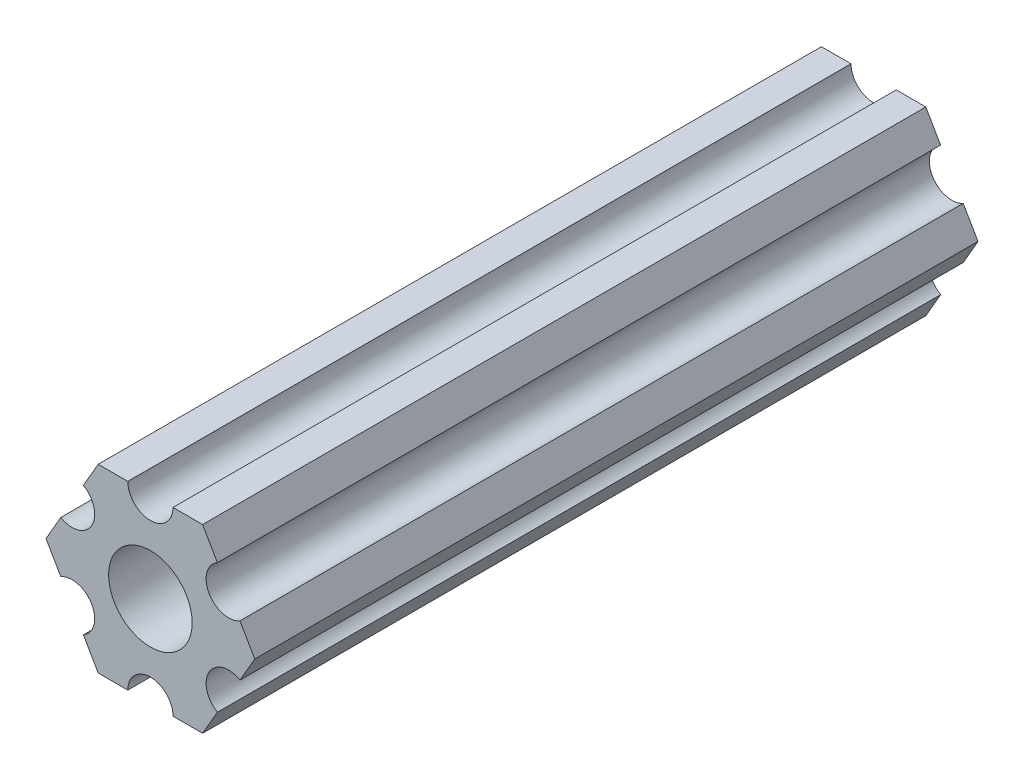
ISO-10303-21;
HEADER;
FILE_DESCRIPTION(('STEP AP214'),'2;1');
FILE_NAME('part.step','',(''),(''),'','','');
FILE_SCHEMA(('AUTOMOTIVE_DESIGN { 1 0 10303 214 1 1 1 1 }'));
ENDSEC;
DATA;
#1=APPLICATION_CONTEXT('core data for automotive mechanical design processes');
#2=APPLICATION_PROTOCOL_DEFINITION('international standard','automotive_design',2000,#1);
#3=PRODUCT_CONTEXT('',#1,'mechanical');
#4=PRODUCT('Part','Part','',(#3));
#5=PRODUCT_RELATED_PRODUCT_CATEGORY('part','',(#4));
#6=PRODUCT_DEFINITION_FORMATION('','',#4);
#7=PRODUCT_DEFINITION_CONTEXT('part definition',#1,'design');
#8=PRODUCT_DEFINITION('design','',#6,#7);
#9=PRODUCT_DEFINITION_SHAPE('','',#8);
#10=(LENGTH_UNIT() NAMED_UNIT(*) SI_UNIT(.MILLI.,.METRE.));
#11=(NAMED_UNIT(*) PLANE_ANGLE_UNIT() SI_UNIT($,.RADIAN.));
#12=(NAMED_UNIT(*) SI_UNIT($,.STERADIAN.) SOLID_ANGLE_UNIT());
#13=UNCERTAINTY_MEASURE_WITH_UNIT(LENGTH_MEASURE(1.E-05),#10,'distance_accuracy_value','');
#14=(GEOMETRIC_REPRESENTATION_CONTEXT(3) GLOBAL_UNCERTAINTY_ASSIGNED_CONTEXT((#13)) GLOBAL_UNIT_ASSIGNED_CONTEXT((#10,
#11,#12)) REPRESENTATION_CONTEXT('',''));
#15=CARTESIAN_POINT('',(0.,0.,0.));
#16=DIRECTION('',(0.,0.,1.));
#17=DIRECTION('',(1.,0.,0.));
#18=AXIS2_PLACEMENT_3D('',#15,#16,#17);
#19=CARTESIAN_POINT('',(5.49926150638083,-3.17499966684068,50.8));
#20=DIRECTION('',(0.,0.,-1.));
#21=DIRECTION('',(-1.,0.,0.));
#22=AXIS2_PLACEMENT_3D('',#19,#20,#21);
#23=CYLINDRICAL_SURFACE('',#22,1.58750000000001);
#24=CARTESIAN_POINT('',(5.49926150638083,-3.17499966684068,0.));
#25=DIRECTION('',(0.,0.,1.));
#26=DIRECTION('',(1.,0.,0.));
#27=AXIS2_PLACEMENT_3D('',#24,#25,#26);
#28=CIRCLE('',#27,1.58750000000001);
#29=CARTESIAN_POINT('',(6.29301142309098,-1.80018429024546,0.));
#30=VERTEX_POINT('',#29);
#31=CARTESIAN_POINT('',(4.70551158967068,-4.54981504343589,0.));
#32=VERTEX_POINT('',#31);
#33=EDGE_CURVE('E189',#30,#32,#28,.T.);
#34=ORIENTED_EDGE('',*,*,#33,.F.);
#35=DIRECTION('',(0.,0.,-1.));
#36=VECTOR('',#35,1.);
#37=CARTESIAN_POINT('',(6.29301142309098,-1.80018429024546,50.8));
#38=LINE('',#37,#36);
#39=CARTESIAN_POINT('',(6.29301142309098,-1.80018429024546,50.8));
#40=VERTEX_POINT('',#39);
#41=EDGE_CURVE('E11',#40,#30,#38,.T.);
#42=ORIENTED_EDGE('',*,*,#41,.F.);
#43=CARTESIAN_POINT('',(5.49926150638083,-3.17499966684068,50.8));
#44=DIRECTION('',(0.,0.,1.));
#45=DIRECTION('',(1.,0.,0.));
#46=AXIS2_PLACEMENT_3D('',#43,#44,#45);
#47=CIRCLE('',#46,1.58750000000001);
#48=CARTESIAN_POINT('',(4.70551158967068,-4.54981504343589,50.8));
#49=VERTEX_POINT('',#48);
#50=EDGE_CURVE('E240',#40,#49,#47,.T.);
#51=ORIENTED_EDGE('',*,*,#50,.T.);
#52=DIRECTION('',(0.,0.,-1.));
#53=VECTOR('',#52,1.);
#54=CARTESIAN_POINT('',(4.70551158967068,-4.54981504343589,50.8));
#55=LINE('',#54,#53);
#56=EDGE_CURVE('E35',#49,#32,#55,.T.);
#57=ORIENTED_EDGE('',*,*,#56,.T.);
#58=EDGE_LOOP('',(#34,#42,#51,#57));
#59=FACE_BOUND('',#58,.T.);
#60=ADVANCED_FACE('F32',(#59),#23,.F.);
#61=CARTESIAN_POINT('',(7.33234841870826,4.44212518856872E-07,50.8));
#62=DIRECTION('',(0.866025434075723,-0.499999947533953,0.));
#63=DIRECTION('',(0.499999947533953,0.866025434075723,0.));
#64=AXIS2_PLACEMENT_3D('',#61,#62,#63);
#65=PLANE('',#64);
#66=DIRECTION('',(-0.499999947533953,-0.866025434075723,0.));
#67=VECTOR('',#66,1.);
#68=CARTESIAN_POINT('',(7.33234841870826,4.44212518856872E-07,0.));
#69=LINE('',#68,#67);
#70=CARTESIAN_POINT('',(7.33234841870826,4.44212518856872E-07,0.));
#71=VERTEX_POINT('',#70);
#72=EDGE_CURVE('E238',#71,#30,#69,.T.);
#73=ORIENTED_EDGE('',*,*,#72,.F.);
#74=DIRECTION('',(0.,0.,-1.));
#75=VECTOR('',#74,1.);
#76=CARTESIAN_POINT('',(7.33234841870826,4.44212518856872E-07,50.8));
#77=LINE('',#76,#75);
#78=CARTESIAN_POINT('',(7.33234841870826,4.44212518856872E-07,50.8));
#79=VERTEX_POINT('',#78);
#80=EDGE_CURVE('E41',#79,#71,#77,.T.);
#81=ORIENTED_EDGE('',*,*,#80,.F.);
#82=DIRECTION('',(-0.499999947533953,-0.866025434075723,0.));
#83=VECTOR('',#82,1.);
#84=CARTESIAN_POINT('',(7.33234841870826,4.44212518856872E-07,50.8));
#85=LINE('',#84,#83);
#86=EDGE_CURVE('E179',#79,#40,#85,.T.);
#87=ORIENTED_EDGE('',*,*,#86,.T.);
#88=ORIENTED_EDGE('',*,*,#41,.T.);
#89=EDGE_LOOP('',(#73,#81,#87,#88));
#90=FACE_BOUND('',#89,.T.);
#91=ADVANCED_FACE('F272',(#90),#65,.T.);
#92=CARTESIAN_POINT('',(6.29301120497139,1.80018505273895,50.8));
#93=DIRECTION('',(0.866025373493145,0.500000052466056,0.));
#94=DIRECTION('',(-0.500000052466056,0.866025373493145,0.));
#95=AXIS2_PLACEMENT_3D('',#92,#93,#94);
#96=PLANE('',#95);
#97=DIRECTION('',(0.500000052466056,-0.866025373493145,0.));
#98=VECTOR('',#97,1.);
#99=CARTESIAN_POINT('',(6.29301120497139,1.80018505273895,0.));
#100=LINE('',#99,#98);
#101=CARTESIAN_POINT('',(6.29301120497139,1.80018505273895,0.));
#102=VERTEX_POINT('',#101);
#103=EDGE_CURVE('E166',#102,#71,#100,.T.);
#104=ORIENTED_EDGE('',*,*,#103,.F.);
#105=DIRECTION('',(0.,0.,-1.));
#106=VECTOR('',#105,1.);
#107=CARTESIAN_POINT('',(6.29301120497139,1.80018505273895,50.8));
#108=LINE('',#107,#106);
#109=CARTESIAN_POINT('',(6.29301120497139,1.80018505273895,50.8));
#110=VERTEX_POINT('',#109);
#111=EDGE_CURVE('E161',#110,#102,#108,.T.);
#112=ORIENTED_EDGE('',*,*,#111,.F.);
#113=DIRECTION('',(0.500000052466056,-0.866025373493145,0.));
#114=VECTOR('',#113,1.);
#115=CARTESIAN_POINT('',(6.29301120497139,1.80018505273895,50.8));
#116=LINE('',#115,#114);
#117=EDGE_CURVE('E164',#110,#79,#116,.T.);
#118=ORIENTED_EDGE('',*,*,#117,.T.);
#119=ORIENTED_EDGE('',*,*,#80,.T.);
#120=EDGE_LOOP('',(#104,#112,#118,#119));
#121=FACE_BOUND('',#120,.T.);
#122=ADVANCED_FACE('F163',(#121),#96,.T.);
#123=CARTESIAN_POINT('',(5.49926112168152,3.17500033315931,50.8));
#124=DIRECTION('',(0.,0.,-1.));
#125=DIRECTION('',(-1.,0.,0.));
#126=AXIS2_PLACEMENT_3D('',#123,#124,#125);
#127=CYLINDRICAL_SURFACE('',#126,1.5875);
#128=CARTESIAN_POINT('',(5.49926112168152,3.17500033315931,0.));
#129=DIRECTION('',(0.,0.,1.));
#130=DIRECTION('',(1.,0.,0.));
#131=AXIS2_PLACEMENT_3D('',#128,#129,#130);
#132=CIRCLE('',#131,1.5875);
#133=CARTESIAN_POINT('',(4.70551103839166,4.54981561357968,0.));
#134=VERTEX_POINT('',#133);
#135=EDGE_CURVE('E235',#134,#102,#132,.T.);
#136=ORIENTED_EDGE('',*,*,#135,.F.);
#137=DIRECTION('',(0.,0.,-1.));
#138=VECTOR('',#137,1.);
#139=CARTESIAN_POINT('',(4.70551103839166,4.54981561357968,50.8));
#140=LINE('',#139,#138);
#141=CARTESIAN_POINT('',(4.70551103839166,4.54981561357968,50.8));
#142=VERTEX_POINT('',#141);
#143=EDGE_CURVE('E171',#142,#134,#140,.T.);
#144=ORIENTED_EDGE('',*,*,#143,.F.);
#145=CARTESIAN_POINT('',(5.49926112168152,3.17500033315931,50.8));
#146=DIRECTION('',(0.,0.,1.));
#147=DIRECTION('',(1.,0.,0.));
#148=AXIS2_PLACEMENT_3D('',#145,#146,#147);
#149=CIRCLE('',#148,1.5875);
#150=EDGE_CURVE('E177',#142,#110,#149,.T.);
#151=ORIENTED_EDGE('',*,*,#150,.T.);
#152=ORIENTED_EDGE('',*,*,#111,.T.);
#153=EDGE_LOOP('',(#136,#144,#151,#152));
#154=FACE_BOUND('',#153,.T.);
#155=ADVANCED_FACE('F181',(#154),#127,.F.);
#156=CARTESIAN_POINT('',(3.66617382465472,6.35000022210622,50.8));
#157=DIRECTION('',(0.866025373493145,0.500000052466056,0.));
#158=DIRECTION('',(-0.500000052466056,0.866025373493145,0.));
#159=AXIS2_PLACEMENT_3D('',#156,#157,#158);
#160=PLANE('',#159);
#161=DIRECTION('',(0.500000052466056,-0.866025373493145,0.));
#162=VECTOR('',#161,1.);
#163=CARTESIAN_POINT('',(3.66617382465472,6.35000022210622,0.));
#164=LINE('',#163,#162);
#165=CARTESIAN_POINT('',(3.66617382465472,6.35000022210622,0.));
#166=VERTEX_POINT('',#165);
#167=EDGE_CURVE('E232',#166,#134,#164,.T.);
#168=ORIENTED_EDGE('',*,*,#167,.F.);
#169=DIRECTION('',(0.,0.,-1.));
#170=VECTOR('',#169,1.);
#171=CARTESIAN_POINT('',(3.66617382465472,6.35000022210622,50.8));
#172=LINE('',#171,#170);
#173=CARTESIAN_POINT('',(3.66617382465472,6.35000022210622,50.8));
#174=VERTEX_POINT('',#173);
#175=EDGE_CURVE('E244',#174,#166,#172,.T.);
#176=ORIENTED_EDGE('',*,*,#175,.F.);
#177=DIRECTION('',(0.500000052466056,-0.866025373493145,0.));
#178=VECTOR('',#177,1.);
#179=CARTESIAN_POINT('',(3.66617382465472,6.35000022210622,50.8));
#180=LINE('',#179,#178);
#181=EDGE_CURVE('E182',#174,#142,#180,.T.);
#182=ORIENTED_EDGE('',*,*,#181,.T.);
#183=ORIENTED_EDGE('',*,*,#143,.T.);
#184=EDGE_LOOP('',(#168,#176,#182,#183));
#185=FACE_BOUND('',#184,.T.);
#186=ADVANCED_FACE('F285',(#185),#160,.T.);
#187=CARTESIAN_POINT('',(1.58749961530066,6.35000022210623,50.8));
#188=DIRECTION('',(0.,1.,0.));
#189=DIRECTION('',(-1.,0.,0.));
#190=AXIS2_PLACEMENT_3D('',#187,#188,#189);
#191=PLANE('',#190);
#192=DIRECTION('',(1.,0.,0.));
#193=VECTOR('',#192,1.);
#194=CARTESIAN_POINT('',(1.58749961530066,6.35000022210623,0.));
#195=LINE('',#194,#193);
#196=CARTESIAN_POINT('',(1.58749961530066,6.35000022210623,0.));
#197=VERTEX_POINT('',#196);
#198=EDGE_CURVE('E229',#197,#166,#195,.T.);
#199=ORIENTED_EDGE('',*,*,#198,.F.);
#200=DIRECTION('',(0.,0.,-1.));
#201=VECTOR('',#200,1.);
#202=CARTESIAN_POINT('',(1.58749961530066,6.35000022210623,50.8));
#203=LINE('',#202,#201);
#204=CARTESIAN_POINT('',(1.58749961530066,6.35000022210623,50.8));
#205=VERTEX_POINT('',#204);
#206=EDGE_CURVE('E246',#205,#197,#203,.T.);
#207=ORIENTED_EDGE('',*,*,#206,.F.);
#208=DIRECTION('',(1.,0.,0.));
#209=VECTOR('',#208,1.);
#210=CARTESIAN_POINT('',(1.58749961530066,6.35000022210623,50.8));
#211=LINE('',#210,#209);
#212=EDGE_CURVE('E184',#205,#174,#211,.T.);
#213=ORIENTED_EDGE('',*,*,#212,.T.);
#214=ORIENTED_EDGE('',*,*,#175,.T.);
#215=EDGE_LOOP('',(#199,#207,#213,#214));
#216=FACE_BOUND('',#215,.T.);
#217=ADVANCED_FACE('F288',(#216),#191,.T.);
#218=CARTESIAN_POINT('',(-3.84699344941095E-07,6.35000022210623,50.8));
#219=DIRECTION('',(0.,0.,-1.));
#220=DIRECTION('',(-1.,0.,0.));
#221=AXIS2_PLACEMENT_3D('',#218,#219,#220);
#222=CYLINDRICAL_SURFACE('',#221,1.5875);
#223=CARTESIAN_POINT('',(-3.84699344941095E-07,6.35000022210623,0.));
#224=DIRECTION('',(0.,0.,1.));
#225=DIRECTION('',(1.,0.,0.));
#226=AXIS2_PLACEMENT_3D('',#223,#224,#225);
#227=CIRCLE('',#226,1.5875);
#228=CARTESIAN_POINT('',(-1.58750038469935,6.35000022210623,0.));
#229=VERTEX_POINT('',#228);
#230=EDGE_CURVE('E226',#229,#197,#227,.T.);
#231=ORIENTED_EDGE('',*,*,#230,.F.);
#232=DIRECTION('',(0.,0.,-1.));
#233=VECTOR('',#232,1.);
#234=CARTESIAN_POINT('',(-1.58750038469935,6.35000022210623,50.8));
#235=LINE('',#234,#233);
#236=CARTESIAN_POINT('',(-1.58750038469935,6.35000022210623,50.8));
#237=VERTEX_POINT('',#236);
#238=EDGE_CURVE('E248',#237,#229,#235,.T.);
#239=ORIENTED_EDGE('',*,*,#238,.F.);
#240=CARTESIAN_POINT('',(-3.84699344941095E-07,6.35000022210623,50.8));
#241=DIRECTION('',(0.,0.,1.));
#242=DIRECTION('',(1.,0.,0.));
#243=AXIS2_PLACEMENT_3D('',#240,#241,#242);
#244=CIRCLE('',#243,1.5875);
#245=EDGE_CURVE('E393',#237,#205,#244,.T.);
#246=ORIENTED_EDGE('',*,*,#245,.T.);
#247=ORIENTED_EDGE('',*,*,#206,.T.);
#248=EDGE_LOOP('',(#231,#239,#246,#247));
#249=FACE_BOUND('',#248,.T.);
#250=ADVANCED_FACE('F292',(#249),#222,.F.);
#251=CARTESIAN_POINT('',(-3.66617452134701,6.35000022210623,50.8));
#252=DIRECTION('',(0.,1.,0.));
#253=DIRECTION('',(0.,0.,1.));
#254=AXIS2_PLACEMENT_3D('',#251,#252,#253);
#255=PLANE('',#254);
#256=DIRECTION('',(1.,0.,0.));
#257=VECTOR('',#256,1.);
#258=CARTESIAN_POINT('',(-3.66617452134701,6.35000022210623,0.));
#259=LINE('',#258,#257);
#260=CARTESIAN_POINT('',(-3.66617452134701,6.35000022210623,0.));
#261=VERTEX_POINT('',#260);
#262=EDGE_CURVE('E223',#261,#229,#259,.T.);
#263=ORIENTED_EDGE('',*,*,#262,.F.);
#264=DIRECTION('',(0.,0.,-1.));
#265=VECTOR('',#264,1.);
#266=CARTESIAN_POINT('',(-3.66617452134701,6.35000022210623,50.8));
#267=LINE('',#266,#265);
#268=CARTESIAN_POINT('',(-3.66617452134701,6.35000022210623,50.8));
#269=VERTEX_POINT('',#268);
#270=EDGE_CURVE('E250',#269,#261,#267,.T.);
#271=ORIENTED_EDGE('',*,*,#270,.F.);
#272=DIRECTION('',(1.,0.,0.));
#273=VECTOR('',#272,1.);
#274=CARTESIAN_POINT('',(-3.66617452134701,6.35000022210623,50.8));
#275=LINE('',#274,#273);
#276=EDGE_CURVE('E390',#269,#237,#275,.T.);
#277=ORIENTED_EDGE('',*,*,#276,.T.);
#278=ORIENTED_EDGE('',*,*,#238,.T.);
#279=EDGE_LOOP('',(#263,#271,#277,#278));
#280=FACE_BOUND('',#279,.T.);
#281=ADVANCED_FACE('F296',(#280),#255,.T.);
#282=CARTESIAN_POINT('',(-4.70551145677116,4.54981548085265,50.8));
#283=DIRECTION('',(-0.866025447431971,0.499999924400249,0.));
#284=DIRECTION('',(-0.499999924400249,-0.866025447431971,0.));
#285=AXIS2_PLACEMENT_3D('',#282,#283,#284);
#286=PLANE('',#285);
#287=DIRECTION('',(0.499999924400249,0.866025447431971,0.));
#288=VECTOR('',#287,1.);
#289=CARTESIAN_POINT('',(-4.70551145677116,4.54981548085265,0.));
#290=LINE('',#289,#288);
#291=CARTESIAN_POINT('',(-4.70551145677116,4.54981548085265,0.));
#292=VERTEX_POINT('',#291);
#293=EDGE_CURVE('E220',#292,#261,#290,.T.);
#294=ORIENTED_EDGE('',*,*,#293,.F.);
#295=DIRECTION('',(0.,0.,-1.));
#296=VECTOR('',#295,1.);
#297=CARTESIAN_POINT('',(-4.70551145677116,4.54981548085265,50.8));
#298=LINE('',#297,#296);
#299=CARTESIAN_POINT('',(-4.70551145677116,4.54981548085265,50.8));
#300=VERTEX_POINT('',#299);
#301=EDGE_CURVE('E252',#300,#292,#298,.T.);
#302=ORIENTED_EDGE('',*,*,#301,.F.);
#303=DIRECTION('',(0.499999924400249,0.866025447431971,0.));
#304=VECTOR('',#303,1.);
#305=CARTESIAN_POINT('',(-4.70551145677116,4.54981548085265,50.8));
#306=LINE('',#305,#304);
#307=EDGE_CURVE('E387',#300,#269,#306,.T.);
#308=ORIENTED_EDGE('',*,*,#307,.T.);
#309=ORIENTED_EDGE('',*,*,#270,.T.);
#310=EDGE_LOOP('',(#294,#302,#308,#309));
#311=FACE_BOUND('',#310,.T.);
#312=ADVANCED_FACE('F300',(#311),#286,.T.);
#313=CARTESIAN_POINT('',(-5.49926133675655,3.17500008305439,50.8));
#314=DIRECTION('',(0.,0.,-1.));
#315=DIRECTION('',(-1.,0.,0.));
#316=AXIS2_PLACEMENT_3D('',#313,#314,#315);
#317=CYLINDRICAL_SURFACE('',#316,1.5875);
#318=CARTESIAN_POINT('',(-5.49926133675655,3.17500008305439,0.));
#319=DIRECTION('',(0.,0.,1.));
#320=DIRECTION('',(1.,0.,0.));
#321=AXIS2_PLACEMENT_3D('',#318,#319,#320);
#322=CIRCLE('',#321,1.5875);
#323=CARTESIAN_POINT('',(-6.29301121674195,1.80018468525613,0.));
#324=VERTEX_POINT('',#323);
#325=EDGE_CURVE('E217',#324,#292,#322,.T.);
#326=ORIENTED_EDGE('',*,*,#325,.F.);
#327=DIRECTION('',(0.,0.,-1.));
#328=VECTOR('',#327,1.);
#329=CARTESIAN_POINT('',(-6.29301121674195,1.80018468525613,50.8));
#330=LINE('',#329,#328);
#331=CARTESIAN_POINT('',(-6.29301121674195,1.80018468525613,50.8));
#332=VERTEX_POINT('',#331);
#333=EDGE_CURVE('E254',#332,#324,#330,.T.);
#334=ORIENTED_EDGE('',*,*,#333,.F.);
#335=CARTESIAN_POINT('',(-5.49926133675655,3.17500008305439,50.8));
#336=DIRECTION('',(0.,0.,1.));
#337=DIRECTION('',(1.,0.,0.));
#338=AXIS2_PLACEMENT_3D('',#335,#336,#337);
#339=CIRCLE('',#338,1.5875);
#340=EDGE_CURVE('E384',#332,#300,#339,.T.);
#341=ORIENTED_EDGE('',*,*,#340,.T.);
#342=ORIENTED_EDGE('',*,*,#301,.T.);
#343=EDGE_LOOP('',(#326,#334,#341,#342));
#344=FACE_BOUND('',#343,.T.);
#345=ADVANCED_FACE('F304',(#344),#317,.F.);
#346=CARTESIAN_POINT('',(-7.33234807945963,6.99338729030344E-08,50.8));
#347=DIRECTION('',(-0.866025447431971,0.499999924400249,0.));
#348=DIRECTION('',(-0.499999924400249,-0.866025447431971,0.));
#349=AXIS2_PLACEMENT_3D('',#346,#347,#348);
#350=PLANE('',#349);
#351=DIRECTION('',(0.499999924400249,0.866025447431971,0.));
#352=VECTOR('',#351,1.);
#353=CARTESIAN_POINT('',(-7.33234807945963,6.99338729030344E-08,0.));
#354=LINE('',#353,#352);
#355=CARTESIAN_POINT('',(-7.33234807945963,6.99338729030344E-08,0.));
#356=VERTEX_POINT('',#355);
#357=EDGE_CURVE('E214',#356,#324,#354,.T.);
#358=ORIENTED_EDGE('',*,*,#357,.F.);
#359=DIRECTION('',(0.,0.,-1.));
#360=VECTOR('',#359,1.);
#361=CARTESIAN_POINT('',(-7.33234807945963,6.99338729030344E-08,50.8));
#362=LINE('',#361,#360);
#363=CARTESIAN_POINT('',(-7.33234807945963,6.99338729030344E-08,50.8));
#364=VERTEX_POINT('',#363);
#365=EDGE_CURVE('E256',#364,#356,#362,.T.);
#366=ORIENTED_EDGE('',*,*,#365,.F.);
#367=DIRECTION('',(0.499999924400249,0.866025447431971,0.));
#368=VECTOR('',#367,1.);
#369=CARTESIAN_POINT('',(-7.33234807945963,6.99338729030344E-08,50.8));
#370=LINE('',#369,#368);
#371=EDGE_CURVE('E381',#364,#332,#370,.T.);
#372=ORIENTED_EDGE('',*,*,#371,.T.);
#373=ORIENTED_EDGE('',*,*,#333,.T.);
#374=EDGE_LOOP('',(#358,#366,#372,#373));
#375=FACE_BOUND('',#374,.T.);
#376=ADVANCED_FACE('F308',(#375),#350,.T.);
#377=CARTESIAN_POINT('',(-6.29301096189761,-1.80018459411914,50.8));
#378=DIRECTION('',(-0.866025400205645,-0.500000006198653,0.));
#379=DIRECTION('',(0.500000006198653,-0.866025400205645,0.));
#380=AXIS2_PLACEMENT_3D('',#377,#378,#379);
#381=PLANE('',#380);
#382=DIRECTION('',(-0.500000006198653,0.866025400205645,0.));
#383=VECTOR('',#382,1.);
#384=CARTESIAN_POINT('',(-6.29301096189761,-1.80018459411914,0.));
#385=LINE('',#384,#383);
#386=CARTESIAN_POINT('',(-6.29301096189761,-1.80018459411914,0.));
#387=VERTEX_POINT('',#386);
#388=EDGE_CURVE('E211',#387,#356,#385,.T.);
#389=ORIENTED_EDGE('',*,*,#388,.F.);
#390=DIRECTION('',(0.,0.,-1.));
#391=VECTOR('',#390,1.);
#392=CARTESIAN_POINT('',(-6.29301096189761,-1.80018459411914,50.8));
#393=LINE('',#392,#391);
#394=CARTESIAN_POINT('',(-6.29301096189761,-1.80018459411914,50.8));
#395=VERTEX_POINT('',#394);
#396=EDGE_CURVE('E258',#395,#387,#393,.T.);
#397=ORIENTED_EDGE('',*,*,#396,.F.);
#398=DIRECTION('',(-0.500000006198653,0.866025400205645,0.));
#399=VECTOR('',#398,1.);
#400=CARTESIAN_POINT('',(-6.29301096189761,-1.80018459411914,50.8));
#401=LINE('',#400,#399);
#402=EDGE_CURVE('E378',#395,#364,#401,.T.);
#403=ORIENTED_EDGE('',*,*,#402,.T.);
#404=ORIENTED_EDGE('',*,*,#365,.T.);
#405=EDGE_LOOP('',(#389,#397,#403,#404));
#406=FACE_BOUND('',#405,.T.);
#407=ADVANCED_FACE('F312',(#406),#381,.T.);
#408=CARTESIAN_POINT('',(-5.49926095205725,-3.1749999169456,50.8));
#409=DIRECTION('',(0.,0.,-1.));
#410=DIRECTION('',(-1.,0.,0.));
#411=AXIS2_PLACEMENT_3D('',#408,#409,#410);
#412=CYLINDRICAL_SURFACE('',#411,1.5875);
#413=CARTESIAN_POINT('',(-5.49926095205725,-3.1749999169456,0.));
#414=DIRECTION('',(0.,0.,1.));
#415=DIRECTION('',(1.,0.,0.));
#416=AXIS2_PLACEMENT_3D('',#413,#414,#415);
#417=CIRCLE('',#416,1.5875);
#418=CARTESIAN_POINT('',(-4.70551094221689,-4.54981523977206,0.));
#419=VERTEX_POINT('',#418);
#420=EDGE_CURVE('E208',#419,#387,#417,.T.);
#421=ORIENTED_EDGE('',*,*,#420,.F.);
#422=DIRECTION('',(0.,0.,-1.));
#423=VECTOR('',#422,1.);
#424=CARTESIAN_POINT('',(-4.70551094221689,-4.54981523977206,50.8));
#425=LINE('',#424,#423);
#426=CARTESIAN_POINT('',(-4.70551094221689,-4.54981523977206,50.8));
#427=VERTEX_POINT('',#426);
#428=EDGE_CURVE('E260',#427,#419,#425,.T.);
#429=ORIENTED_EDGE('',*,*,#428,.F.);
#430=CARTESIAN_POINT('',(-5.49926095205725,-3.1749999169456,50.8));
#431=DIRECTION('',(0.,0.,1.));
#432=DIRECTION('',(1.,0.,0.));
#433=AXIS2_PLACEMENT_3D('',#430,#431,#432);
#434=CIRCLE('',#433,1.5875);
#435=EDGE_CURVE('E375',#427,#395,#434,.T.);
#436=ORIENTED_EDGE('',*,*,#435,.T.);
#437=ORIENTED_EDGE('',*,*,#396,.T.);
#438=EDGE_LOOP('',(#421,#429,#436,#437));
#439=FACE_BOUND('',#438,.T.);
#440=ADVANCED_FACE('F316',(#439),#412,.F.);
#441=CARTESIAN_POINT('',(-3.66617382465481,-6.34999990382519,50.8));
#442=DIRECTION('',(-0.866025400205644,-0.500000006198653,0.));
#443=DIRECTION('',(0.500000006198653,-0.866025400205645,0.));
#444=AXIS2_PLACEMENT_3D('',#441,#442,#443);
#445=PLANE('',#444);
#446=DIRECTION('',(-0.500000006198653,0.866025400205644,0.));
#447=VECTOR('',#446,1.);
#448=CARTESIAN_POINT('',(-3.66617382465481,-6.34999990382519,0.));
#449=LINE('',#448,#447);
#450=CARTESIAN_POINT('',(-3.66617382465481,-6.34999990382519,0.));
#451=VERTEX_POINT('',#450);
#452=EDGE_CURVE('E205',#451,#419,#449,.T.);
#453=ORIENTED_EDGE('',*,*,#452,.F.);
#454=DIRECTION('',(0.,0.,-1.));
#455=VECTOR('',#454,1.);
#456=CARTESIAN_POINT('',(-3.66617382465481,-6.34999990382519,50.8));
#457=LINE('',#456,#455);
#458=CARTESIAN_POINT('',(-3.66617382465481,-6.34999990382519,50.8));
#459=VERTEX_POINT('',#458);
#460=EDGE_CURVE('E262',#459,#451,#457,.T.);
#461=ORIENTED_EDGE('',*,*,#460,.F.);
#462=DIRECTION('',(-0.500000006198653,0.866025400205644,0.));
#463=VECTOR('',#462,1.);
#464=CARTESIAN_POINT('',(-3.66617382465481,-6.34999990382519,50.8));
#465=LINE('',#464,#463);
#466=EDGE_CURVE('E372',#459,#427,#465,.T.);
#467=ORIENTED_EDGE('',*,*,#466,.T.);
#468=ORIENTED_EDGE('',*,*,#428,.T.);
#469=EDGE_LOOP('',(#453,#461,#467,#468));
#470=FACE_BOUND('',#469,.T.);
#471=ADVANCED_FACE('F320',(#470),#445,.T.);
#472=CARTESIAN_POINT('',(-1.58749961530074,-6.34999990382519,50.8));
#473=DIRECTION('',(0.,-1.,0.));
#474=DIRECTION('',(1.,0.,0.));
#475=AXIS2_PLACEMENT_3D('',#472,#473,#474);
#476=PLANE('',#475);
#477=DIRECTION('',(-1.,0.,0.));
#478=VECTOR('',#477,1.);
#479=CARTESIAN_POINT('',(-1.58749961530074,-6.34999990382519,0.));
#480=LINE('',#479,#478);
#481=CARTESIAN_POINT('',(-1.58749961530074,-6.34999990382519,0.));
#482=VERTEX_POINT('',#481);
#483=EDGE_CURVE('E202',#482,#451,#480,.T.);
#484=ORIENTED_EDGE('',*,*,#483,.F.);
#485=DIRECTION('',(0.,0.,-1.));
#486=VECTOR('',#485,1.);
#487=CARTESIAN_POINT('',(-1.58749961530074,-6.34999990382519,50.8));
#488=LINE('',#487,#486);
#489=CARTESIAN_POINT('',(-1.58749961530074,-6.34999990382519,50.8));
#490=VERTEX_POINT('',#489);
#491=EDGE_CURVE('E264',#490,#482,#488,.T.);
#492=ORIENTED_EDGE('',*,*,#491,.F.);
#493=DIRECTION('',(-1.,0.,0.));
#494=VECTOR('',#493,1.);
#495=CARTESIAN_POINT('',(-1.58749961530074,-6.34999990382519,50.8));
#496=LINE('',#495,#494);
#497=EDGE_CURVE('E369',#490,#459,#496,.T.);
#498=ORIENTED_EDGE('',*,*,#497,.T.);
#499=ORIENTED_EDGE('',*,*,#460,.T.);
#500=EDGE_LOOP('',(#484,#492,#498,#499));
#501=FACE_BOUND('',#500,.T.);
#502=ADVANCED_FACE('F324',(#501),#476,.T.);
#503=CARTESIAN_POINT('',(3.8469926204343E-07,-6.34999990382519,50.8));
#504=DIRECTION('',(0.,0.,-1.));
#505=DIRECTION('',(-1.,0.,0.));
#506=AXIS2_PLACEMENT_3D('',#503,#504,#505);
#507=CYLINDRICAL_SURFACE('',#506,1.5875);
#508=CARTESIAN_POINT('',(3.8469926204343E-07,-6.34999990382519,0.));
#509=DIRECTION('',(0.,0.,1.));
#510=DIRECTION('',(1.,0.,0.));
#511=AXIS2_PLACEMENT_3D('',#508,#509,#510);
#512=CIRCLE('',#511,1.5875);
#513=CARTESIAN_POINT('',(1.58750038469926,-6.34999990382518,0.));
#514=VERTEX_POINT('',#513);
#515=EDGE_CURVE('E199',#514,#482,#512,.T.);
#516=ORIENTED_EDGE('',*,*,#515,.F.);
#517=DIRECTION('',(0.,0.,-1.));
#518=VECTOR('',#517,1.);
#519=CARTESIAN_POINT('',(1.58750038469926,-6.34999990382518,50.8));
#520=LINE('',#519,#518);
#521=CARTESIAN_POINT('',(1.58750038469926,-6.34999990382518,50.8));
#522=VERTEX_POINT('',#521);
#523=EDGE_CURVE('E266',#522,#514,#520,.T.);
#524=ORIENTED_EDGE('',*,*,#523,.F.);
#525=CARTESIAN_POINT('',(3.8469926204343E-07,-6.34999990382519,50.8));
#526=DIRECTION('',(0.,0.,1.));
#527=DIRECTION('',(1.,0.,0.));
#528=AXIS2_PLACEMENT_3D('',#525,#526,#527);
#529=CIRCLE('',#528,1.5875);
#530=EDGE_CURVE('E366',#522,#490,#529,.T.);
#531=ORIENTED_EDGE('',*,*,#530,.T.);
#532=ORIENTED_EDGE('',*,*,#491,.T.);
#533=EDGE_LOOP('',(#516,#524,#531,#532));
#534=FACE_BOUND('',#533,.T.);
#535=ADVANCED_FACE('F328',(#534),#507,.F.);
#536=CARTESIAN_POINT('',(3.66617452134693,-6.34999990382519,50.8));
#537=DIRECTION('',(0.,-1.,0.));
#538=DIRECTION('',(1.,0.,0.));
#539=AXIS2_PLACEMENT_3D('',#536,#537,#538);
#540=PLANE('',#539);
#541=DIRECTION('',(-1.,0.,0.));
#542=VECTOR('',#541,1.);
#543=CARTESIAN_POINT('',(3.66617452134693,-6.34999990382519,0.));
#544=LINE('',#543,#542);
#545=CARTESIAN_POINT('',(3.66617452134693,-6.34999990382519,0.));
#546=VERTEX_POINT('',#545);
#547=EDGE_CURVE('E196',#546,#514,#544,.T.);
#548=ORIENTED_EDGE('',*,*,#547,.F.);
#549=DIRECTION('',(0.,0.,-1.));
#550=VECTOR('',#549,1.);
#551=CARTESIAN_POINT('',(3.66617452134693,-6.34999990382519,50.8));
#552=LINE('',#551,#550);
#553=CARTESIAN_POINT('',(3.66617452134693,-6.34999990382519,50.8));
#554=VERTEX_POINT('',#553);
#555=EDGE_CURVE('E267',#554,#546,#552,.T.);
#556=ORIENTED_EDGE('',*,*,#555,.F.);
#557=DIRECTION('',(-1.,0.,0.));
#558=VECTOR('',#557,1.);
#559=CARTESIAN_POINT('',(3.66617452134693,-6.34999990382519,50.8));
#560=LINE('',#559,#558);
#561=EDGE_CURVE('E363',#554,#522,#560,.T.);
#562=ORIENTED_EDGE('',*,*,#561,.T.);
#563=ORIENTED_EDGE('',*,*,#523,.T.);
#564=EDGE_LOOP('',(#548,#556,#562,#563));
#565=FACE_BOUND('',#564,.T.);
#566=ADVANCED_FACE('F332',(#565),#540,.T.);
#567=CARTESIAN_POINT('',(4.70551158967068,-4.54981504343589,50.8));
#568=DIRECTION('',(0.866025434075723,-0.499999947533953,0.));
#569=DIRECTION('',(0.499999947533953,0.866025434075723,0.));
#570=AXIS2_PLACEMENT_3D('',#567,#568,#569);
#571=PLANE('',#570);
#572=DIRECTION('',(-0.499999947533953,-0.866025434075723,0.));
#573=VECTOR('',#572,1.);
#574=CARTESIAN_POINT('',(4.70551158967068,-4.54981504343589,0.));
#575=LINE('',#574,#573);
#576=EDGE_CURVE('E192',#32,#546,#575,.T.);
#577=ORIENTED_EDGE('',*,*,#576,.F.);
#578=ORIENTED_EDGE('',*,*,#56,.F.);
#579=DIRECTION('',(-0.499999947533953,-0.866025434075723,0.));
#580=VECTOR('',#579,1.);
#581=CARTESIAN_POINT('',(4.70551158967068,-4.54981504343589,50.8));
#582=LINE('',#581,#580);
#583=EDGE_CURVE('E361',#49,#554,#582,.T.);
#584=ORIENTED_EDGE('',*,*,#583,.T.);
#585=ORIENTED_EDGE('',*,*,#555,.T.);
#586=EDGE_LOOP('',(#577,#578,#584,#585));
#587=FACE_BOUND('',#586,.T.);
#588=ADVANCED_FACE('F269',(#587),#571,.T.);
#589=CARTESIAN_POINT('',(5.49926150638083,-3.17499966684068,50.8));
#590=DIRECTION('',(0.,0.,1.));
#591=DIRECTION('',(1.,0.,0.));
#592=AXIS2_PLACEMENT_3D('',#589,#590,#591);
#593=PLANE('',#592);
#594=CARTESIAN_POINT('',(0.,0.,50.8));
#595=DIRECTION('',(0.,0.,-1.));
#596=DIRECTION('',(1.,0.,0.));
#597=AXIS2_PLACEMENT_3D('',#594,#595,#596);
#598=CIRCLE('',#597,2.9337);
#599=CARTESIAN_POINT('',(2.9337,0.,50.8));
#600=VERTEX_POINT('',#599);
#601=EDGE_CURVE('E193',#600,#600,#598,.T.);
#602=ORIENTED_EDGE('',*,*,#601,.T.);
#603=EDGE_LOOP('',(#602));
#604=FACE_BOUND('',#603,.T.);
#605=ORIENTED_EDGE('',*,*,#50,.F.);
#606=ORIENTED_EDGE('',*,*,#86,.F.);
#607=ORIENTED_EDGE('',*,*,#117,.F.);
#608=ORIENTED_EDGE('',*,*,#150,.F.);
#609=ORIENTED_EDGE('',*,*,#181,.F.);
#610=ORIENTED_EDGE('',*,*,#212,.F.);
#611=ORIENTED_EDGE('',*,*,#245,.F.);
#612=ORIENTED_EDGE('',*,*,#276,.F.);
#613=ORIENTED_EDGE('',*,*,#307,.F.);
#614=ORIENTED_EDGE('',*,*,#340,.F.);
#615=ORIENTED_EDGE('',*,*,#371,.F.);
#616=ORIENTED_EDGE('',*,*,#402,.F.);
#617=ORIENTED_EDGE('',*,*,#435,.F.);
#618=ORIENTED_EDGE('',*,*,#466,.F.);
#619=ORIENTED_EDGE('',*,*,#497,.F.);
#620=ORIENTED_EDGE('',*,*,#530,.F.);
#621=ORIENTED_EDGE('',*,*,#561,.F.);
#622=ORIENTED_EDGE('',*,*,#583,.F.);
#623=EDGE_LOOP('',(#605,#606,#607,#608,#609,#610,#611,#612,#613,#614,#615,#616,#617,#618,#619,
#620,#621,#622));
#624=FACE_BOUND('',#623,.T.);
#625=ADVANCED_FACE('F175',(#604,#624),#593,.T.);
#626=CARTESIAN_POINT('',(5.49926150638083,-3.17499966684068,0.));
#627=DIRECTION('',(0.,0.,1.));
#628=DIRECTION('',(1.,0.,0.));
#629=AXIS2_PLACEMENT_3D('',#626,#627,#628);
#630=PLANE('',#629);
#631=CARTESIAN_POINT('',(0.,0.,0.));
#632=DIRECTION('',(0.,0.,-1.));
#633=DIRECTION('',(1.,0.,0.));
#634=AXIS2_PLACEMENT_3D('',#631,#632,#633);
#635=CIRCLE('',#634,2.9337);
#636=CARTESIAN_POINT('',(2.9337,0.,0.));
#637=VERTEX_POINT('',#636);
#638=EDGE_CURVE('E356',#637,#637,#635,.T.);
#639=ORIENTED_EDGE('',*,*,#638,.F.);
#640=EDGE_LOOP('',(#639));
#641=FACE_BOUND('',#640,.T.);
#642=ORIENTED_EDGE('',*,*,#33,.T.);
#643=ORIENTED_EDGE('',*,*,#576,.T.);
#644=ORIENTED_EDGE('',*,*,#547,.T.);
#645=ORIENTED_EDGE('',*,*,#515,.T.);
#646=ORIENTED_EDGE('',*,*,#483,.T.);
#647=ORIENTED_EDGE('',*,*,#452,.T.);
#648=ORIENTED_EDGE('',*,*,#420,.T.);
#649=ORIENTED_EDGE('',*,*,#388,.T.);
#650=ORIENTED_EDGE('',*,*,#357,.T.);
#651=ORIENTED_EDGE('',*,*,#325,.T.);
#652=ORIENTED_EDGE('',*,*,#293,.T.);
#653=ORIENTED_EDGE('',*,*,#262,.T.);
#654=ORIENTED_EDGE('',*,*,#230,.T.);
#655=ORIENTED_EDGE('',*,*,#198,.T.);
#656=ORIENTED_EDGE('',*,*,#167,.T.);
#657=ORIENTED_EDGE('',*,*,#135,.T.);
#658=ORIENTED_EDGE('',*,*,#103,.T.);
#659=ORIENTED_EDGE('',*,*,#72,.T.);
#660=EDGE_LOOP('',(#642,#643,#644,#645,#646,#647,#648,#649,#650,#651,#652,#653,#654,#655,#656,
#657,#658,#659));
#661=FACE_BOUND('',#660,.T.);
#662=ADVANCED_FACE('F271',(#641,#661),#630,.F.);
#663=CARTESIAN_POINT('',(0.,0.,50.8));
#664=DIRECTION('',(0.,0.,-1.));
#665=DIRECTION('',(-1.,0.,0.));
#666=AXIS2_PLACEMENT_3D('',#663,#664,#665);
#667=CYLINDRICAL_SURFACE('',#666,2.9337);
#668=ORIENTED_EDGE('',*,*,#601,.F.);
#669=EDGE_LOOP('',(#668));
#670=FACE_BOUND('',#669,.T.);
#671=ORIENTED_EDGE('',*,*,#638,.T.);
#672=EDGE_LOOP('',(#671));
#673=FACE_BOUND('',#672,.T.);
#674=ADVANCED_FACE('F344',(#670,#673),#667,.F.);
#675=CLOSED_SHELL('',(#60,#91,#122,#155,#186,#217,#250,#281,#312,#345,#376,#407,#440,#471,#502,
#535,#566,#588,#625,#662,#674));
#676=MANIFOLD_SOLID_BREP('B2',#675);
#677=ADVANCED_BREP_SHAPE_REPRESENTATION('',(#18,#676),#14);
#678=SHAPE_DEFINITION_REPRESENTATION(#9,#677);
ENDSEC;
END-ISO-10303-21;
